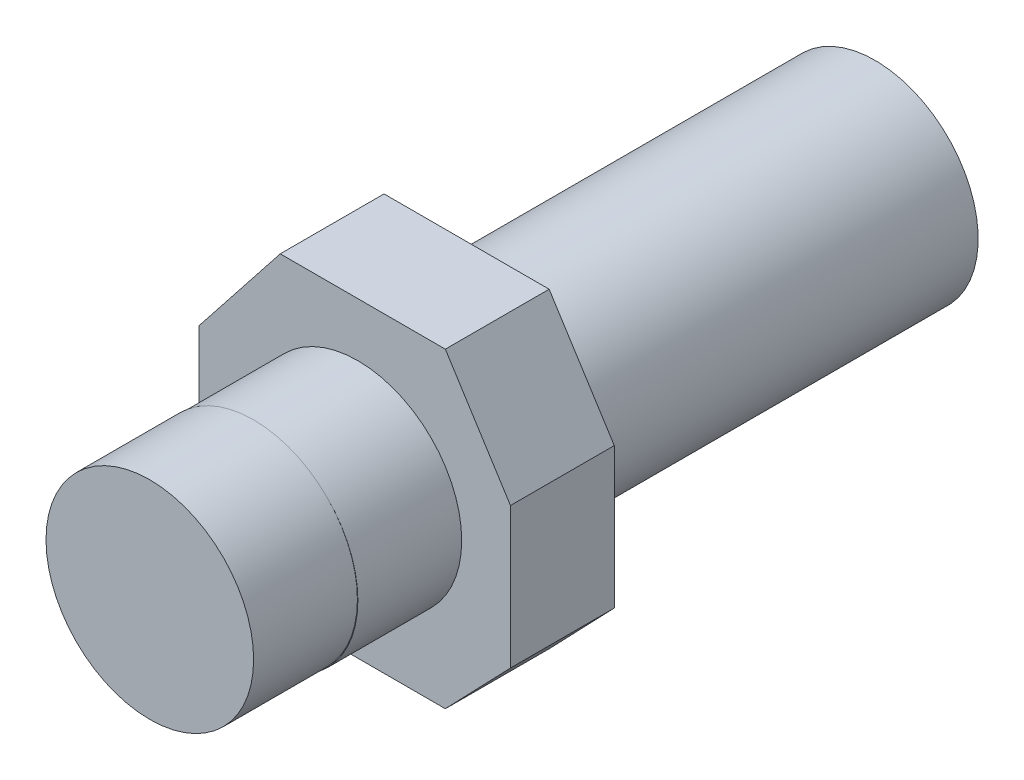
ISO-10303-21;
HEADER;
FILE_DESCRIPTION(('STEP AP214'),'2;1');
FILE_NAME('part.step','',(''),(''),'','','');
FILE_SCHEMA(('AUTOMOTIVE_DESIGN { 1 0 10303 214 1 1 1 1 }'));
ENDSEC;
DATA;
#1=APPLICATION_CONTEXT('core data for automotive mechanical design processes');
#2=APPLICATION_PROTOCOL_DEFINITION('international standard','automotive_design',2000,#1);
#3=PRODUCT_CONTEXT('',#1,'mechanical');
#4=PRODUCT('Part','Part','',(#3));
#5=PRODUCT_RELATED_PRODUCT_CATEGORY('part','',(#4));
#6=PRODUCT_DEFINITION_FORMATION('','',#4);
#7=PRODUCT_DEFINITION_CONTEXT('part definition',#1,'design');
#8=PRODUCT_DEFINITION('design','',#6,#7);
#9=PRODUCT_DEFINITION_SHAPE('','',#8);
#10=(LENGTH_UNIT() NAMED_UNIT(*) SI_UNIT(.MILLI.,.METRE.));
#11=(NAMED_UNIT(*) PLANE_ANGLE_UNIT() SI_UNIT($,.RADIAN.));
#12=(NAMED_UNIT(*) SI_UNIT($,.STERADIAN.) SOLID_ANGLE_UNIT());
#13=UNCERTAINTY_MEASURE_WITH_UNIT(LENGTH_MEASURE(1.E-05),#10,'distance_accuracy_value','');
#14=(GEOMETRIC_REPRESENTATION_CONTEXT(3) GLOBAL_UNCERTAINTY_ASSIGNED_CONTEXT((#13)) GLOBAL_UNIT_ASSIGNED_CONTEXT((#10,
#11,#12)) REPRESENTATION_CONTEXT('',''));
#15=CARTESIAN_POINT('',(0.,0.,0.));
#16=DIRECTION('',(0.,0.,1.));
#17=DIRECTION('',(1.,0.,0.));
#18=AXIS2_PLACEMENT_3D('',#15,#16,#17);
#19=CARTESIAN_POINT('',(-4.6073531721352,6.25797101449275,10.));
#20=DIRECTION('',(0.784882765533426,-0.61964428857902,0.));
#21=DIRECTION('',(0.61964428857902,0.784882765533426,0.));
#22=AXIS2_PLACEMENT_3D('',#19,#20,#21);
#23=PLANE('',#22);
#24=DIRECTION('',(-0.61964428857902,-0.784882765533426,0.));
#25=VECTOR('',#24,1.);
#26=CARTESIAN_POINT('',(-4.6073531721352,6.25797101449275,0.));
#27=LINE('',#26,#25);
#28=CARTESIAN_POINT('',(3.21511059598073,16.1664251207729,0.));
#29=VERTEX_POINT('',#28);
#30=CARTESIAN_POINT('',(-4.6073531721352,6.25797101449275,0.));
#31=VERTEX_POINT('',#30);
#32=EDGE_CURVE('E153',#29,#31,#27,.T.);
#33=ORIENTED_EDGE('',*,*,#32,.T.);
#34=DIRECTION('',(0.,0.,-1.));
#35=VECTOR('',#34,1.);
#36=CARTESIAN_POINT('',(-4.6073531721352,6.25797101449275,10.));
#37=LINE('',#36,#35);
#38=CARTESIAN_POINT('',(-4.6073531721352,6.25797101449275,10.));
#39=VERTEX_POINT('',#38);
#40=EDGE_CURVE('E44',#39,#31,#37,.T.);
#41=ORIENTED_EDGE('',*,*,#40,.F.);
#42=DIRECTION('',(-0.61964428857902,-0.784882765533426,0.));
#43=VECTOR('',#42,1.);
#44=CARTESIAN_POINT('',(-4.6073531721352,6.25797101449275,10.));
#45=LINE('',#44,#43);
#46=CARTESIAN_POINT('',(3.21511059598073,16.1664251207729,10.));
#47=VERTEX_POINT('',#46);
#48=EDGE_CURVE('E177',#47,#39,#45,.T.);
#49=ORIENTED_EDGE('',*,*,#48,.F.);
#50=DIRECTION('',(0.,0.,-1.));
#51=VECTOR('',#50,1.);
#52=CARTESIAN_POINT('',(3.21511059598073,16.1664251207729,10.));
#53=LINE('',#52,#51);
#54=EDGE_CURVE('E149',#47,#29,#53,.T.);
#55=ORIENTED_EDGE('',*,*,#54,.T.);
#56=EDGE_LOOP('',(#33,#41,#49,#55));
#57=FACE_BOUND('',#56,.T.);
#58=ADVANCED_FACE('F41',(#57),#23,.F.);
#59=CARTESIAN_POINT('',(-4.6073531721352,-7.30096618357487,10.));
#60=DIRECTION('',(1.,0.,0.));
#61=DIRECTION('',(0.,0.,-1.));
#62=AXIS2_PLACEMENT_3D('',#59,#60,#61);
#63=PLANE('',#62);
#64=DIRECTION('',(0.,-1.,0.));
#65=VECTOR('',#64,1.);
#66=CARTESIAN_POINT('',(-4.6073531721352,-7.30096618357487,0.));
#67=LINE('',#66,#65);
#68=CARTESIAN_POINT('',(-4.6073531721352,-7.30096618357487,0.));
#69=VERTEX_POINT('',#68);
#70=EDGE_CURVE('E157',#31,#69,#67,.T.);
#71=ORIENTED_EDGE('',*,*,#70,.T.);
#72=DIRECTION('',(0.,0.,-1.));
#73=VECTOR('',#72,1.);
#74=CARTESIAN_POINT('',(-4.6073531721352,-7.30096618357487,10.));
#75=LINE('',#74,#73);
#76=CARTESIAN_POINT('',(-4.6073531721352,-7.30096618357487,10.));
#77=VERTEX_POINT('',#76);
#78=EDGE_CURVE('E191',#77,#69,#75,.T.);
#79=ORIENTED_EDGE('',*,*,#78,.F.);
#80=DIRECTION('',(0.,-1.,0.));
#81=VECTOR('',#80,1.);
#82=CARTESIAN_POINT('',(-4.6073531721352,-7.30096618357487,10.));
#83=LINE('',#82,#81);
#84=EDGE_CURVE('E107',#39,#77,#83,.T.);
#85=ORIENTED_EDGE('',*,*,#84,.F.);
#86=ORIENTED_EDGE('',*,*,#40,.T.);
#87=EDGE_LOOP('',(#71,#79,#85,#86));
#88=FACE_BOUND('',#87,.T.);
#89=ADVANCED_FACE('F264',(#88),#63,.F.);
#90=CARTESIAN_POINT('',(3.21511059598073,-13.8335748792271,10.));
#91=DIRECTION('',(0.64098832210659,0.767550630853092,0.));
#92=DIRECTION('',(-0.767550630853092,0.64098832210659,0.));
#93=AXIS2_PLACEMENT_3D('',#90,#91,#92);
#94=PLANE('',#93);
#95=DIRECTION('',(0.767550630853091,-0.64098832210659,0.));
#96=VECTOR('',#95,1.);
#97=CARTESIAN_POINT('',(3.21511059598073,-13.8335748792271,0.));
#98=LINE('',#97,#96);
#99=CARTESIAN_POINT('',(3.21511059598073,-13.8335748792271,0.));
#100=VERTEX_POINT('',#99);
#101=EDGE_CURVE('E161',#69,#100,#98,.T.);
#102=ORIENTED_EDGE('',*,*,#101,.T.);
#103=DIRECTION('',(0.,0.,-1.));
#104=VECTOR('',#103,1.);
#105=CARTESIAN_POINT('',(3.21511059598073,-13.8335748792271,10.));
#106=LINE('',#105,#104);
#107=CARTESIAN_POINT('',(3.21511059598073,-13.8335748792271,10.));
#108=VERTEX_POINT('',#107);
#109=EDGE_CURVE('E188',#108,#100,#106,.T.);
#110=ORIENTED_EDGE('',*,*,#109,.F.);
#111=DIRECTION('',(0.767550630853091,-0.64098832210659,0.));
#112=VECTOR('',#111,1.);
#113=CARTESIAN_POINT('',(3.21511059598073,-13.8335748792271,10.));
#114=LINE('',#113,#112);
#115=EDGE_CURVE('E214',#77,#108,#114,.T.);
#116=ORIENTED_EDGE('',*,*,#115,.F.);
#117=ORIENTED_EDGE('',*,*,#78,.T.);
#118=EDGE_LOOP('',(#102,#110,#116,#117));
#119=FACE_BOUND('',#118,.T.);
#120=ADVANCED_FACE('F268',(#119),#94,.F.);
#121=CARTESIAN_POINT('',(19.1207869244832,-13.8335748792271,10.));
#122=DIRECTION('',(0.,1.,0.));
#123=DIRECTION('',(0.,0.,1.));
#124=AXIS2_PLACEMENT_3D('',#121,#122,#123);
#125=PLANE('',#124);
#126=DIRECTION('',(1.,0.,0.));
#127=VECTOR('',#126,1.);
#128=CARTESIAN_POINT('',(19.1207869244832,-13.8335748792271,0.));
#129=LINE('',#128,#127);
#130=CARTESIAN_POINT('',(19.1207869244832,-13.8335748792271,0.));
#131=VERTEX_POINT('',#130);
#132=EDGE_CURVE('E164',#100,#131,#129,.T.);
#133=ORIENTED_EDGE('',*,*,#132,.T.);
#134=DIRECTION('',(0.,0.,-1.));
#135=VECTOR('',#134,1.);
#136=CARTESIAN_POINT('',(19.1207869244832,-13.8335748792271,10.));
#137=LINE('',#136,#135);
#138=CARTESIAN_POINT('',(19.1207869244832,-13.8335748792271,10.));
#139=VERTEX_POINT('',#138);
#140=EDGE_CURVE('E184',#139,#131,#137,.T.);
#141=ORIENTED_EDGE('',*,*,#140,.F.);
#142=DIRECTION('',(1.,0.,0.));
#143=VECTOR('',#142,1.);
#144=CARTESIAN_POINT('',(19.1207869244832,-13.8335748792271,10.));
#145=LINE('',#144,#143);
#146=EDGE_CURVE('E217',#108,#139,#145,.T.);
#147=ORIENTED_EDGE('',*,*,#146,.F.);
#148=ORIENTED_EDGE('',*,*,#109,.T.);
#149=EDGE_LOOP('',(#133,#141,#147,#148));
#150=FACE_BOUND('',#149,.T.);
#151=ADVANCED_FACE('F272',(#150),#125,.F.);
#152=CARTESIAN_POINT('',(25.3926468278648,-7.30096618357487,10.));
#153=DIRECTION('',(-0.721356672535713,0.692563752291588,0.));
#154=DIRECTION('',(-0.692563752291588,-0.721356672535713,0.));
#155=AXIS2_PLACEMENT_3D('',#152,#153,#154);
#156=PLANE('',#155);
#157=DIRECTION('',(0.692563752291588,0.721356672535713,0.));
#158=VECTOR('',#157,1.);
#159=CARTESIAN_POINT('',(25.3926468278648,-7.30096618357487,0.));
#160=LINE('',#159,#158);
#161=CARTESIAN_POINT('',(25.3926468278648,-7.30096618357487,0.));
#162=VERTEX_POINT('',#161);
#163=EDGE_CURVE('E167',#131,#162,#160,.T.);
#164=ORIENTED_EDGE('',*,*,#163,.T.);
#165=DIRECTION('',(0.,0.,-1.));
#166=VECTOR('',#165,1.);
#167=CARTESIAN_POINT('',(25.3926468278648,-7.30096618357487,10.));
#168=LINE('',#167,#166);
#169=CARTESIAN_POINT('',(25.3926468278648,-7.30096618357487,10.));
#170=VERTEX_POINT('',#169);
#171=EDGE_CURVE('E142',#170,#162,#168,.T.);
#172=ORIENTED_EDGE('',*,*,#171,.F.);
#173=DIRECTION('',(0.692563752291588,0.721356672535713,0.));
#174=VECTOR('',#173,1.);
#175=CARTESIAN_POINT('',(25.3926468278648,-7.30096618357487,10.));
#176=LINE('',#175,#174);
#177=EDGE_CURVE('E128',#139,#170,#176,.T.);
#178=ORIENTED_EDGE('',*,*,#177,.F.);
#179=ORIENTED_EDGE('',*,*,#140,.T.);
#180=EDGE_LOOP('',(#164,#172,#178,#179));
#181=FACE_BOUND('',#180,.T.);
#182=ADVANCED_FACE('F277',(#181),#156,.F.);
#183=CARTESIAN_POINT('',(25.3926468278648,6.25797101449275,10.));
#184=DIRECTION('',(-1.,0.,0.));
#185=DIRECTION('',(0.,0.,1.));
#186=AXIS2_PLACEMENT_3D('',#183,#184,#185);
#187=PLANE('',#186);
#188=DIRECTION('',(0.,1.,0.));
#189=VECTOR('',#188,1.);
#190=CARTESIAN_POINT('',(25.3926468278648,6.25797101449275,0.));
#191=LINE('',#190,#189);
#192=CARTESIAN_POINT('',(25.3926468278648,6.25797101449275,0.));
#193=VERTEX_POINT('',#192);
#194=EDGE_CURVE('E138',#162,#193,#191,.T.);
#195=ORIENTED_EDGE('',*,*,#194,.T.);
#196=DIRECTION('',(0.,0.,-1.));
#197=VECTOR('',#196,1.);
#198=CARTESIAN_POINT('',(25.3926468278648,6.25797101449275,10.));
#199=LINE('',#198,#197);
#200=CARTESIAN_POINT('',(25.3926468278648,6.25797101449275,10.));
#201=VERTEX_POINT('',#200);
#202=EDGE_CURVE('E135',#201,#193,#199,.T.);
#203=ORIENTED_EDGE('',*,*,#202,.F.);
#204=DIRECTION('',(0.,1.,0.));
#205=VECTOR('',#204,1.);
#206=CARTESIAN_POINT('',(25.3926468278648,6.25797101449275,10.));
#207=LINE('',#206,#205);
#208=EDGE_CURVE('E121',#170,#201,#207,.T.);
#209=ORIENTED_EDGE('',*,*,#208,.F.);
#210=ORIENTED_EDGE('',*,*,#171,.T.);
#211=EDGE_LOOP('',(#195,#203,#209,#210));
#212=FACE_BOUND('',#211,.T.);
#213=ADVANCED_FACE('F136',(#212),#187,.F.);
#214=CARTESIAN_POINT('',(19.1207869244832,16.1664251207729,10.));
#215=DIRECTION('',(-0.844953744857486,-0.534839386219181,0.));
#216=DIRECTION('',(0.534839386219181,-0.844953744857486,0.));
#217=AXIS2_PLACEMENT_3D('',#214,#215,#216);
#218=PLANE('',#217);
#219=DIRECTION('',(-0.534839386219181,0.844953744857486,0.));
#220=VECTOR('',#219,1.);
#221=CARTESIAN_POINT('',(19.1207869244832,16.1664251207729,0.));
#222=LINE('',#221,#220);
#223=CARTESIAN_POINT('',(19.1207869244832,16.1664251207729,0.));
#224=VERTEX_POINT('',#223);
#225=EDGE_CURVE('E172',#193,#224,#222,.T.);
#226=ORIENTED_EDGE('',*,*,#225,.T.);
#227=DIRECTION('',(0.,0.,-1.));
#228=VECTOR('',#227,1.);
#229=CARTESIAN_POINT('',(19.1207869244832,16.1664251207729,10.));
#230=LINE('',#229,#228);
#231=CARTESIAN_POINT('',(19.1207869244832,16.1664251207729,10.));
#232=VERTEX_POINT('',#231);
#233=EDGE_CURVE('E143',#232,#224,#230,.T.);
#234=ORIENTED_EDGE('',*,*,#233,.F.);
#235=DIRECTION('',(-0.534839386219181,0.844953744857486,0.));
#236=VECTOR('',#235,1.);
#237=CARTESIAN_POINT('',(19.1207869244832,16.1664251207729,10.));
#238=LINE('',#237,#236);
#239=EDGE_CURVE('E125',#201,#232,#238,.T.);
#240=ORIENTED_EDGE('',*,*,#239,.F.);
#241=ORIENTED_EDGE('',*,*,#202,.T.);
#242=EDGE_LOOP('',(#226,#234,#240,#241));
#243=FACE_BOUND('',#242,.T.);
#244=ADVANCED_FACE('F145',(#243),#218,.F.);
#245=CARTESIAN_POINT('',(3.21511059598073,16.1664251207729,10.));
#246=DIRECTION('',(0.,-1.,0.));
#247=DIRECTION('',(0.,0.,-1.));
#248=AXIS2_PLACEMENT_3D('',#245,#246,#247);
#249=PLANE('',#248);
#250=DIRECTION('',(-1.,0.,0.));
#251=VECTOR('',#250,1.);
#252=CARTESIAN_POINT('',(3.21511059598073,16.1664251207729,0.));
#253=LINE('',#252,#251);
#254=EDGE_CURVE('E98',#224,#29,#253,.T.);
#255=ORIENTED_EDGE('',*,*,#254,.T.);
#256=ORIENTED_EDGE('',*,*,#54,.F.);
#257=DIRECTION('',(-1.,0.,0.));
#258=VECTOR('',#257,1.);
#259=CARTESIAN_POINT('',(3.21511059598073,16.1664251207729,10.));
#260=LINE('',#259,#258);
#261=EDGE_CURVE('E65',#232,#47,#260,.T.);
#262=ORIENTED_EDGE('',*,*,#261,.F.);
#263=ORIENTED_EDGE('',*,*,#233,.T.);
#264=EDGE_LOOP('',(#255,#256,#262,#263));
#265=FACE_BOUND('',#264,.T.);
#266=ADVANCED_FACE('F253',(#265),#249,.F.);
#267=CARTESIAN_POINT('',(0.,0.,10.));
#268=DIRECTION('',(0.,0.,1.));
#269=DIRECTION('',(1.,0.,0.));
#270=AXIS2_PLACEMENT_3D('',#267,#268,#269);
#271=PLANE('',#270);
#272=CARTESIAN_POINT('',(10.6958651656435,0.993157499185136,10.));
#273=DIRECTION('',(0.,0.,1.));
#274=DIRECTION('',(1.,0.,0.));
#275=AXIS2_PLACEMENT_3D('',#272,#273,#274);
#276=CIRCLE('',#275,10.);
#277=CARTESIAN_POINT('',(20.6958651656435,0.993157499185136,10.));
#278=VERTEX_POINT('',#277);
#279=EDGE_CURVE('E198',#278,#278,#276,.T.);
#280=ORIENTED_EDGE('',*,*,#279,.F.);
#281=EDGE_LOOP('',(#280));
#282=FACE_BOUND('',#281,.T.);
#283=ORIENTED_EDGE('',*,*,#48,.T.);
#284=ORIENTED_EDGE('',*,*,#84,.T.);
#285=ORIENTED_EDGE('',*,*,#115,.T.);
#286=ORIENTED_EDGE('',*,*,#146,.T.);
#287=ORIENTED_EDGE('',*,*,#177,.T.);
#288=ORIENTED_EDGE('',*,*,#208,.T.);
#289=ORIENTED_EDGE('',*,*,#239,.T.);
#290=ORIENTED_EDGE('',*,*,#261,.T.);
#291=EDGE_LOOP('',(#283,#284,#285,#286,#287,#288,#289,#290));
#292=FACE_BOUND('',#291,.T.);
#293=ADVANCED_FACE('F123',(#282,#292),#271,.T.);
#294=CARTESIAN_POINT('',(0.,0.,0.));
#295=DIRECTION('',(0.,0.,1.));
#296=DIRECTION('',(1.,0.,0.));
#297=AXIS2_PLACEMENT_3D('',#294,#295,#296);
#298=PLANE('',#297);
#299=CARTESIAN_POINT('',(10.5225975440556,1.03647440458196,0.));
#300=DIRECTION('',(0.,0.,-1.));
#301=DIRECTION('',(-1.,0.,0.));
#302=AXIS2_PLACEMENT_3D('',#299,#300,#301);
#303=CIRCLE('',#302,9.92496084036597);
#304=CARTESIAN_POINT('',(0.59763670368959,1.03647440458196,0.));
#305=VERTEX_POINT('',#304);
#306=EDGE_CURVE('E11',#305,#305,#303,.T.);
#307=ORIENTED_EDGE('',*,*,#306,.F.);
#308=EDGE_LOOP('',(#307));
#309=FACE_BOUND('',#308,.T.);
#310=ORIENTED_EDGE('',*,*,#32,.F.);
#311=ORIENTED_EDGE('',*,*,#254,.F.);
#312=ORIENTED_EDGE('',*,*,#225,.F.);
#313=ORIENTED_EDGE('',*,*,#194,.F.);
#314=ORIENTED_EDGE('',*,*,#163,.F.);
#315=ORIENTED_EDGE('',*,*,#132,.F.);
#316=ORIENTED_EDGE('',*,*,#101,.F.);
#317=ORIENTED_EDGE('',*,*,#70,.F.);
#318=EDGE_LOOP('',(#310,#311,#312,#313,#314,#315,#316,#317));
#319=FACE_BOUND('',#318,.T.);
#320=ADVANCED_FACE('F245',(#309,#319),#298,.F.);
#321=CARTESIAN_POINT('',(10.6958651656435,0.993157499185136,20.));
#322=DIRECTION('',(0.,0.,-1.));
#323=DIRECTION('',(-1.,0.,0.));
#324=AXIS2_PLACEMENT_3D('',#321,#322,#323);
#325=CYLINDRICAL_SURFACE('',#324,10.);
#326=CARTESIAN_POINT('',(10.6958651656435,0.993157499185136,20.));
#327=DIRECTION('',(0.,0.,1.));
#328=DIRECTION('',(1.,0.,0.));
#329=AXIS2_PLACEMENT_3D('',#326,#327,#328);
#330=CIRCLE('',#329,10.);
#331=CARTESIAN_POINT('',(17.7452413551635,8.08585059409835,20.));
#332=VERTEX_POINT('',#331);
#333=CARTESIAN_POINT('',(3.60317207072463,-6.05621869032908,20.));
#334=VERTEX_POINT('',#333);
#335=EDGE_CURVE('E158',#332,#334,#330,.T.);
#336=ORIENTED_EDGE('',*,*,#335,.F.);
#337=EDGE_CURVE('E223',#334,#332,#330,.T.);
#338=ORIENTED_EDGE('',*,*,#337,.F.);
#339=EDGE_LOOP('',(#336,#338));
#340=FACE_BOUND('',#339,.T.);
#341=ORIENTED_EDGE('',*,*,#279,.T.);
#342=EDGE_LOOP('',(#341));
#343=FACE_BOUND('',#342,.T.);
#344=ADVANCED_FACE('F248',(#340,#343),#325,.T.);
#345=CARTESIAN_POINT('',(10.6958651656435,0.993157499185136,20.));
#346=DIRECTION('',(0.,0.,1.));
#347=DIRECTION('',(1.,0.,0.));
#348=AXIS2_PLACEMENT_3D('',#345,#346,#347);
#349=PLANE('',#348);
#350=CARTESIAN_POINT('',(10.6525482602466,1.03647440458213,20.));
#351=DIRECTION('',(0.,0.,1.));
#352=DIRECTION('',(1.,0.,0.));
#353=AXIS2_PLACEMENT_3D('',#350,#351,#352);
#354=CIRCLE('',#353,10.);
#355=EDGE_CURVE('E50',#334,#332,#354,.T.);
#356=ORIENTED_EDGE('',*,*,#355,.F.);
#357=ORIENTED_EDGE('',*,*,#337,.T.);
#358=EDGE_LOOP('',(#356,#357));
#359=FACE_BOUND('',#358,.T.);
#360=ADVANCED_FACE('F311',(#359),#349,.T.);
#361=CARTESIAN_POINT('',(10.6525482602466,1.03647440458213,20.));
#362=DIRECTION('',(0.,0.,1.));
#363=DIRECTION('',(1.,0.,0.));
#364=AXIS2_PLACEMENT_3D('',#361,#362,#363);
#365=PLANE('',#364);
#366=EDGE_CURVE('E207',#332,#334,#354,.T.);
#367=ORIENTED_EDGE('',*,*,#366,.F.);
#368=ORIENTED_EDGE('',*,*,#335,.T.);
#369=EDGE_LOOP('',(#367,#368));
#370=FACE_BOUND('',#369,.T.);
#371=ADVANCED_FACE('F321',(#370),#365,.F.);
#372=CARTESIAN_POINT('',(10.6525482602466,1.03647440458213,30.));
#373=DIRECTION('',(0.,0.,-1.));
#374=DIRECTION('',(-1.,0.,0.));
#375=AXIS2_PLACEMENT_3D('',#372,#373,#374);
#376=CYLINDRICAL_SURFACE('',#375,10.);
#377=CARTESIAN_POINT('',(10.6525482602466,1.03647440458213,30.));
#378=DIRECTION('',(0.,0.,1.));
#379=DIRECTION('',(1.,0.,0.));
#380=AXIS2_PLACEMENT_3D('',#377,#378,#379);
#381=CIRCLE('',#380,10.);
#382=CARTESIAN_POINT('',(20.6525482602466,1.03647440458213,30.));
#383=VERTEX_POINT('',#382);
#384=EDGE_CURVE('E225',#383,#383,#381,.T.);
#385=ORIENTED_EDGE('',*,*,#384,.F.);
#386=EDGE_LOOP('',(#385));
#387=FACE_BOUND('',#386,.T.);
#388=ORIENTED_EDGE('',*,*,#366,.T.);
#389=ORIENTED_EDGE('',*,*,#355,.T.);
#390=EDGE_LOOP('',(#388,#389));
#391=FACE_BOUND('',#390,.T.);
#392=ADVANCED_FACE('F330',(#387,#391),#376,.T.);
#393=CARTESIAN_POINT('',(10.6525482602466,1.03647440458213,30.));
#394=DIRECTION('',(0.,0.,1.));
#395=DIRECTION('',(1.,0.,0.));
#396=AXIS2_PLACEMENT_3D('',#393,#394,#395);
#397=PLANE('',#396);
#398=ORIENTED_EDGE('',*,*,#384,.T.);
#399=EDGE_LOOP('',(#398));
#400=FACE_BOUND('',#399,.T.);
#401=ADVANCED_FACE('F241',(#400),#397,.T.);
#402=CARTESIAN_POINT('',(10.5225975440556,1.03647440458196,-40.));
#403=DIRECTION('',(0.,0.,1.));
#404=DIRECTION('',(1.,0.,0.));
#405=AXIS2_PLACEMENT_3D('',#402,#403,#404);
#406=CYLINDRICAL_SURFACE('',#405,9.92496084036597);
#407=CARTESIAN_POINT('',(10.5225975440556,1.03647440458196,-40.));
#408=DIRECTION('',(0.,0.,-1.));
#409=DIRECTION('',(-1.,0.,0.));
#410=AXIS2_PLACEMENT_3D('',#407,#408,#409);
#411=CIRCLE('',#410,9.92496084036597);
#412=CARTESIAN_POINT('',(0.59763670368959,1.03647440458196,-40.));
#413=VERTEX_POINT('',#412);
#414=EDGE_CURVE('E231',#413,#413,#411,.T.);
#415=ORIENTED_EDGE('',*,*,#414,.F.);
#416=EDGE_LOOP('',(#415));
#417=FACE_BOUND('',#416,.T.);
#418=ORIENTED_EDGE('',*,*,#306,.T.);
#419=EDGE_LOOP('',(#418));
#420=FACE_BOUND('',#419,.T.);
#421=ADVANCED_FACE('F238',(#417,#420),#406,.T.);
#422=CARTESIAN_POINT('',(10.5225975440556,1.03647440458196,-40.));
#423=DIRECTION('',(0.,0.,-1.));
#424=DIRECTION('',(-1.,0.,0.));
#425=AXIS2_PLACEMENT_3D('',#422,#423,#424);
#426=PLANE('',#425);
#427=ORIENTED_EDGE('',*,*,#414,.T.);
#428=EDGE_LOOP('',(#427));
#429=FACE_BOUND('',#428,.T.);
#430=ADVANCED_FACE('F236',(#429),#426,.T.);
#431=CLOSED_SHELL('',(#58,#89,#120,#151,#182,#213,#244,#266,#293,#320,#344,#360,#371,#392,#401,
#421,#430));
#432=MANIFOLD_SOLID_BREP('B2',#431);
#433=ADVANCED_BREP_SHAPE_REPRESENTATION('',(#18,#432),#14);
#434=SHAPE_DEFINITION_REPRESENTATION(#9,#433);
ENDSEC;
END-ISO-10303-21;
